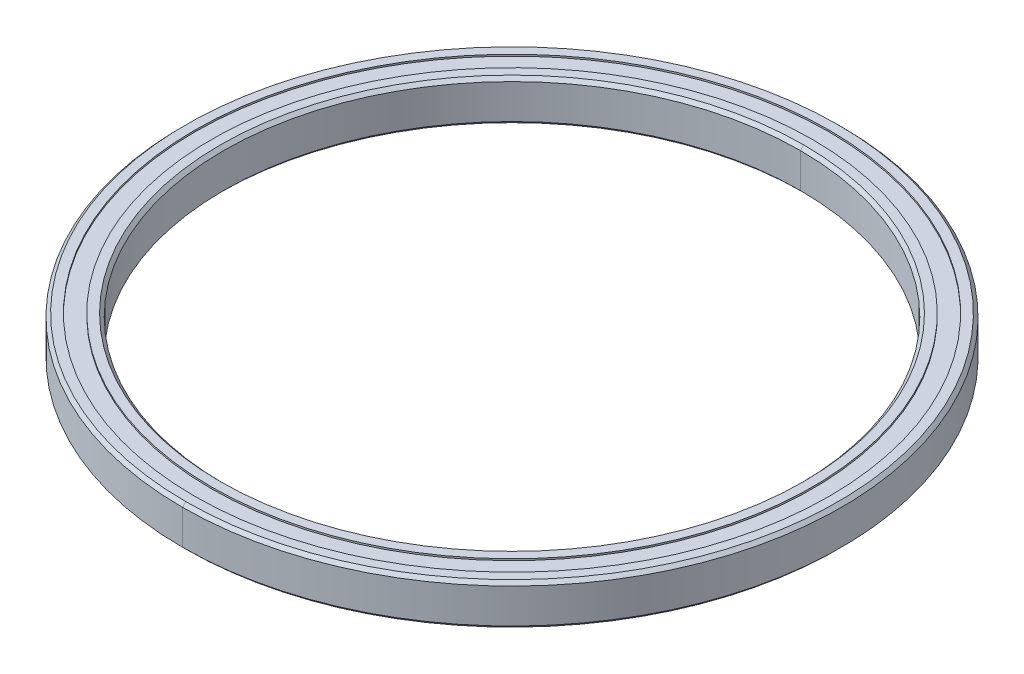
ISO-10303-21;
HEADER;
FILE_DESCRIPTION(('STEP AP214'),'2;1');
FILE_NAME('part.step','',(''),(''),'','','');
FILE_SCHEMA(('AUTOMOTIVE_DESIGN { 1 0 10303 214 1 1 1 1 }'));
ENDSEC;
DATA;
#1=APPLICATION_CONTEXT('core data for automotive mechanical design processes');
#2=APPLICATION_PROTOCOL_DEFINITION('international standard','automotive_design',2000,#1);
#3=PRODUCT_CONTEXT('',#1,'mechanical');
#4=PRODUCT('Part','Part','',(#3));
#5=PRODUCT_RELATED_PRODUCT_CATEGORY('part','',(#4));
#6=PRODUCT_DEFINITION_FORMATION('','',#4);
#7=PRODUCT_DEFINITION_CONTEXT('part definition',#1,'design');
#8=PRODUCT_DEFINITION('design','',#6,#7);
#9=PRODUCT_DEFINITION_SHAPE('','',#8);
#10=(LENGTH_UNIT() NAMED_UNIT(*) SI_UNIT(.MILLI.,.METRE.));
#11=(NAMED_UNIT(*) PLANE_ANGLE_UNIT() SI_UNIT($,.RADIAN.));
#12=(NAMED_UNIT(*) SI_UNIT($,.STERADIAN.) SOLID_ANGLE_UNIT());
#13=UNCERTAINTY_MEASURE_WITH_UNIT(LENGTH_MEASURE(1.E-05),#10,'distance_accuracy_value','');
#14=(GEOMETRIC_REPRESENTATION_CONTEXT(3) GLOBAL_UNCERTAINTY_ASSIGNED_CONTEXT((#13)) GLOBAL_UNIT_ASSIGNED_CONTEXT((#10,
#11,#12)) REPRESENTATION_CONTEXT('',''));
#15=CARTESIAN_POINT('',(0.,0.,0.));
#16=DIRECTION('',(0.,0.,1.));
#17=DIRECTION('',(1.,0.,0.));
#18=AXIS2_PLACEMENT_3D('',#15,#16,#17);
#19=CARTESIAN_POINT('',(0.,0.,0.));
#20=DIRECTION('',(0.,-1.,0.));
#21=DIRECTION('',(0.,0.,-1.));
#22=AXIS2_PLACEMENT_3D('',#19,#20,#21);
#23=CYLINDRICAL_SURFACE('',#22,50.8);
#24=DIRECTION('',(0.,-1.,0.));
#25=VECTOR('',#24,1.);
#26=CARTESIAN_POINT('',(0.,0.,50.8));
#27=LINE('',#26,#25);
#28=CARTESIAN_POINT('',(0.,2.667,50.8));
#29=VERTEX_POINT('',#28);
#30=CARTESIAN_POINT('',(0.,-2.667,50.8));
#31=VERTEX_POINT('',#30);
#32=EDGE_CURVE('E296',#29,#31,#27,.T.);
#33=ORIENTED_EDGE('',*,*,#32,.F.);
#34=CARTESIAN_POINT('',(0.,2.667,0.));
#35=DIRECTION('',(0.,-1.,0.));
#36=DIRECTION('',(0.,0.,-1.));
#37=AXIS2_PLACEMENT_3D('',#34,#35,#36);
#38=CIRCLE('',#37,50.8);
#39=CARTESIAN_POINT('',(0.,2.667,-50.8));
#40=VERTEX_POINT('',#39);
#41=EDGE_CURVE('E115',#29,#40,#38,.T.);
#42=ORIENTED_EDGE('',*,*,#41,.T.);
#43=DIRECTION('',(0.,-1.,0.));
#44=VECTOR('',#43,1.);
#45=CARTESIAN_POINT('',(0.,0.,-50.8));
#46=LINE('',#45,#44);
#47=CARTESIAN_POINT('',(0.,-2.667,-50.8));
#48=VERTEX_POINT('',#47);
#49=EDGE_CURVE('E357',#40,#48,#46,.T.);
#50=ORIENTED_EDGE('',*,*,#49,.T.);
#51=CARTESIAN_POINT('',(0.,-2.667,0.));
#52=DIRECTION('',(0.,-1.,0.));
#53=DIRECTION('',(0.,0.,-1.));
#54=AXIS2_PLACEMENT_3D('',#51,#52,#53);
#55=CIRCLE('',#54,50.8);
#56=EDGE_CURVE('E11',#31,#48,#55,.T.);
#57=ORIENTED_EDGE('',*,*,#56,.F.);
#58=EDGE_LOOP('',(#33,#42,#50,#57));
#59=FACE_BOUND('',#58,.T.);
#60=ADVANCED_FACE('F16',(#59),#23,.T.);
#61=CARTESIAN_POINT('',(0.,-2.667,0.));
#62=DIRECTION('',(0.,1.,0.));
#63=DIRECTION('',(0.,0.,1.));
#64=AXIS2_PLACEMENT_3D('',#61,#62,#63);
#65=CONICAL_SURFACE('',#64,50.8,0.785398163397446);
#66=DIRECTION('',(0.,0.707106781186549,-0.707106781186546));
#67=VECTOR('',#66,1.);
#68=CARTESIAN_POINT('',(0.,-2.667,-50.8));
#69=LINE('',#68,#67);
#70=CARTESIAN_POINT('',(0.,-3.175,-50.292));
#71=VERTEX_POINT('',#70);
#72=EDGE_CURVE('E356',#71,#48,#69,.T.);
#73=ORIENTED_EDGE('',*,*,#72,.F.);
#74=CARTESIAN_POINT('',(0.,-3.175,0.));
#75=DIRECTION('',(0.,-1.,0.));
#76=DIRECTION('',(0.,0.,-1.));
#77=AXIS2_PLACEMENT_3D('',#74,#75,#76);
#78=CIRCLE('',#77,50.292);
#79=CARTESIAN_POINT('',(0.,-3.175,50.292));
#80=VERTEX_POINT('',#79);
#81=EDGE_CURVE('E27',#80,#71,#78,.T.);
#82=ORIENTED_EDGE('',*,*,#81,.F.);
#83=DIRECTION('',(0.,0.707106781186549,0.707106781186546));
#84=VECTOR('',#83,1.);
#85=CARTESIAN_POINT('',(0.,-2.667,50.8));
#86=LINE('',#85,#84);
#87=EDGE_CURVE('E247',#80,#31,#86,.T.);
#88=ORIENTED_EDGE('',*,*,#87,.T.);
#89=ORIENTED_EDGE('',*,*,#56,.T.);
#90=EDGE_LOOP('',(#73,#82,#88,#89));
#91=FACE_BOUND('',#90,.T.);
#92=ADVANCED_FACE('F403',(#91),#65,.T.);
#93=CARTESIAN_POINT('',(-48.895,-3.175,0.));
#94=DIRECTION('',(0.,1.,0.));
#95=DIRECTION('',(1.,0.,0.));
#96=AXIS2_PLACEMENT_3D('',#93,#94,#95);
#97=PLANE('',#96);
#98=CARTESIAN_POINT('',(0.,-3.175,0.));
#99=DIRECTION('',(0.,-1.,0.));
#100=DIRECTION('',(0.,0.,-1.));
#101=AXIS2_PLACEMENT_3D('',#98,#99,#100);
#102=CIRCLE('',#101,48.895);
#103=CARTESIAN_POINT('',(0.,-3.175,-48.895));
#104=VERTEX_POINT('',#103);
#105=CARTESIAN_POINT('',(0.,-3.175,48.895));
#106=VERTEX_POINT('',#105);
#107=EDGE_CURVE('E90',#104,#106,#102,.T.);
#108=ORIENTED_EDGE('',*,*,#107,.F.);
#109=CARTESIAN_POINT('',(0.,-3.175,0.));
#110=DIRECTION('',(0.,-1.,0.));
#111=DIRECTION('',(0.,0.,-1.));
#112=AXIS2_PLACEMENT_3D('',#109,#110,#111);
#113=CIRCLE('',#112,48.895);
#114=EDGE_CURVE('E252',#106,#104,#113,.T.);
#115=ORIENTED_EDGE('',*,*,#114,.F.);
#116=EDGE_LOOP('',(#108,#115));
#117=FACE_BOUND('',#116,.T.);
#118=ORIENTED_EDGE('',*,*,#81,.T.);
#119=CARTESIAN_POINT('',(0.,-3.175,0.));
#120=DIRECTION('',(0.,-1.,0.));
#121=DIRECTION('',(0.,0.,-1.));
#122=AXIS2_PLACEMENT_3D('',#119,#120,#121);
#123=CIRCLE('',#122,50.292);
#124=EDGE_CURVE('E352',#71,#80,#123,.T.);
#125=ORIENTED_EDGE('',*,*,#124,.T.);
#126=EDGE_LOOP('',(#118,#125));
#127=FACE_BOUND('',#126,.T.);
#128=ADVANCED_FACE('F399',(#117,#127),#97,.F.);
#129=CARTESIAN_POINT('',(0.,0.,0.));
#130=DIRECTION('',(0.,-1.,0.));
#131=DIRECTION('',(0.,0.,-1.));
#132=AXIS2_PLACEMENT_3D('',#129,#130,#131);
#133=CYLINDRICAL_SURFACE('',#132,48.895);
#134=DIRECTION('',(0.,-1.,0.));
#135=VECTOR('',#134,1.);
#136=CARTESIAN_POINT('',(0.,0.,48.895));
#137=LINE('',#136,#135);
#138=CARTESIAN_POINT('',(0.,-2.921,48.895));
#139=VERTEX_POINT('',#138);
#140=EDGE_CURVE('E246',#139,#106,#137,.T.);
#141=ORIENTED_EDGE('',*,*,#140,.F.);
#142=CARTESIAN_POINT('',(0.,-2.921,0.));
#143=DIRECTION('',(0.,-1.,0.));
#144=DIRECTION('',(0.,0.,-1.));
#145=AXIS2_PLACEMENT_3D('',#142,#143,#144);
#146=CIRCLE('',#145,48.895);
#147=CARTESIAN_POINT('',(0.,-2.921,-48.895));
#148=VERTEX_POINT('',#147);
#149=EDGE_CURVE('E301',#148,#139,#146,.T.);
#150=ORIENTED_EDGE('',*,*,#149,.F.);
#151=DIRECTION('',(0.,-1.,0.));
#152=VECTOR('',#151,1.);
#153=CARTESIAN_POINT('',(0.,0.,-48.895));
#154=LINE('',#153,#152);
#155=EDGE_CURVE('E248',#148,#104,#154,.T.);
#156=ORIENTED_EDGE('',*,*,#155,.T.);
#157=ORIENTED_EDGE('',*,*,#107,.T.);
#158=EDGE_LOOP('',(#141,#150,#156,#157));
#159=FACE_BOUND('',#158,.T.);
#160=ADVANCED_FACE('F402',(#159),#133,.F.);
#161=CARTESIAN_POINT('',(-46.355,-2.921,0.));
#162=DIRECTION('',(0.,1.,0.));
#163=DIRECTION('',(1.,0.,0.));
#164=AXIS2_PLACEMENT_3D('',#161,#162,#163);
#165=PLANE('',#164);
#166=CARTESIAN_POINT('',(0.,-2.921,0.));
#167=DIRECTION('',(0.,-1.,0.));
#168=DIRECTION('',(0.,0.,-1.));
#169=AXIS2_PLACEMENT_3D('',#166,#167,#168);
#170=CIRCLE('',#169,46.355);
#171=CARTESIAN_POINT('',(0.,-2.921,-46.355));
#172=VERTEX_POINT('',#171);
#173=CARTESIAN_POINT('',(0.,-2.921,46.355));
#174=VERTEX_POINT('',#173);
#175=EDGE_CURVE('E251',#172,#174,#170,.T.);
#176=ORIENTED_EDGE('',*,*,#175,.F.);
#177=CARTESIAN_POINT('',(0.,-2.921,0.));
#178=DIRECTION('',(0.,-1.,0.));
#179=DIRECTION('',(0.,0.,-1.));
#180=AXIS2_PLACEMENT_3D('',#177,#178,#179);
#181=CIRCLE('',#180,46.355);
#182=EDGE_CURVE('E74',#174,#172,#181,.T.);
#183=ORIENTED_EDGE('',*,*,#182,.F.);
#184=EDGE_LOOP('',(#176,#183));
#185=FACE_BOUND('',#184,.T.);
#186=ORIENTED_EDGE('',*,*,#149,.T.);
#187=CARTESIAN_POINT('',(0.,-2.921,0.));
#188=DIRECTION('',(0.,-1.,0.));
#189=DIRECTION('',(0.,0.,-1.));
#190=AXIS2_PLACEMENT_3D('',#187,#188,#189);
#191=CIRCLE('',#190,48.895);
#192=EDGE_CURVE('E242',#139,#148,#191,.T.);
#193=ORIENTED_EDGE('',*,*,#192,.T.);
#194=EDGE_LOOP('',(#186,#193));
#195=FACE_BOUND('',#194,.T.);
#196=ADVANCED_FACE('F476',(#185,#195),#165,.F.);
#197=CARTESIAN_POINT('',(0.,0.,0.));
#198=DIRECTION('',(0.,-1.,0.));
#199=DIRECTION('',(0.,0.,-1.));
#200=AXIS2_PLACEMENT_3D('',#197,#198,#199);
#201=CYLINDRICAL_SURFACE('',#200,46.355);
#202=DIRECTION('',(0.,-1.,0.));
#203=VECTOR('',#202,1.);
#204=CARTESIAN_POINT('',(0.,0.,46.355));
#205=LINE('',#204,#203);
#206=CARTESIAN_POINT('',(0.,-3.175,46.355));
#207=VERTEX_POINT('',#206);
#208=EDGE_CURVE('E264',#174,#207,#205,.T.);
#209=ORIENTED_EDGE('',*,*,#208,.F.);
#210=ORIENTED_EDGE('',*,*,#182,.T.);
#211=DIRECTION('',(0.,-1.,0.));
#212=VECTOR('',#211,1.);
#213=CARTESIAN_POINT('',(0.,0.,-46.355));
#214=LINE('',#213,#212);
#215=CARTESIAN_POINT('',(0.,-3.175,-46.355));
#216=VERTEX_POINT('',#215);
#217=EDGE_CURVE('E276',#172,#216,#214,.T.);
#218=ORIENTED_EDGE('',*,*,#217,.T.);
#219=CARTESIAN_POINT('',(0.,-3.175,0.));
#220=DIRECTION('',(0.,-1.,0.));
#221=DIRECTION('',(0.,0.,-1.));
#222=AXIS2_PLACEMENT_3D('',#219,#220,#221);
#223=CIRCLE('',#222,46.355);
#224=EDGE_CURVE('E362',#207,#216,#223,.T.);
#225=ORIENTED_EDGE('',*,*,#224,.F.);
#226=EDGE_LOOP('',(#209,#210,#218,#225));
#227=FACE_BOUND('',#226,.T.);
#228=ADVANCED_FACE('F443',(#227),#201,.T.);
#229=CARTESIAN_POINT('',(-44.958,-3.175,0.));
#230=DIRECTION('',(0.,1.,0.));
#231=DIRECTION('',(1.,0.,0.));
#232=AXIS2_PLACEMENT_3D('',#229,#230,#231);
#233=PLANE('',#232);
#234=CARTESIAN_POINT('',(0.,-3.175,0.));
#235=DIRECTION('',(0.,-1.,0.));
#236=DIRECTION('',(0.,0.,-1.));
#237=AXIS2_PLACEMENT_3D('',#234,#235,#236);
#238=CIRCLE('',#237,44.958);
#239=CARTESIAN_POINT('',(0.,-3.175,-44.958));
#240=VERTEX_POINT('',#239);
#241=CARTESIAN_POINT('',(0.,-3.175,44.958));
#242=VERTEX_POINT('',#241);
#243=EDGE_CURVE('E173',#240,#242,#238,.T.);
#244=ORIENTED_EDGE('',*,*,#243,.F.);
#245=CARTESIAN_POINT('',(0.,-3.175,0.));
#246=DIRECTION('',(0.,-1.,0.));
#247=DIRECTION('',(0.,0.,-1.));
#248=AXIS2_PLACEMENT_3D('',#245,#246,#247);
#249=CIRCLE('',#248,44.958);
#250=EDGE_CURVE('E291',#242,#240,#249,.T.);
#251=ORIENTED_EDGE('',*,*,#250,.F.);
#252=EDGE_LOOP('',(#244,#251));
#253=FACE_BOUND('',#252,.T.);
#254=CARTESIAN_POINT('',(0.,-3.175,0.));
#255=DIRECTION('',(0.,-1.,0.));
#256=DIRECTION('',(0.,0.,-1.));
#257=AXIS2_PLACEMENT_3D('',#254,#255,#256);
#258=CIRCLE('',#257,46.355);
#259=EDGE_CURVE('E267',#216,#207,#258,.T.);
#260=ORIENTED_EDGE('',*,*,#259,.T.);
#261=ORIENTED_EDGE('',*,*,#224,.T.);
#262=EDGE_LOOP('',(#260,#261));
#263=FACE_BOUND('',#262,.T.);
#264=ADVANCED_FACE('F470',(#253,#263),#233,.F.);
#265=CARTESIAN_POINT('',(0.,-3.175,0.));
#266=DIRECTION('',(0.,-1.,0.));
#267=DIRECTION('',(0.,0.,-1.));
#268=AXIS2_PLACEMENT_3D('',#265,#266,#267);
#269=CONICAL_SURFACE('',#268,44.958,0.785398163397445);
#270=DIRECTION('',(0.,-0.70710678118655,0.707106781186545));
#271=VECTOR('',#270,1.);
#272=CARTESIAN_POINT('',(0.,-3.175,44.958));
#273=LINE('',#272,#271);
#274=CARTESIAN_POINT('',(0.,-2.667,44.45));
#275=VERTEX_POINT('',#274);
#276=EDGE_CURVE('E287',#275,#242,#273,.T.);
#277=ORIENTED_EDGE('',*,*,#276,.F.);
#278=CARTESIAN_POINT('',(0.,-2.667,0.));
#279=DIRECTION('',(0.,-1.,0.));
#280=DIRECTION('',(0.,0.,-1.));
#281=AXIS2_PLACEMENT_3D('',#278,#279,#280);
#282=CIRCLE('',#281,44.45);
#283=CARTESIAN_POINT('',(0.,-2.667,-44.45));
#284=VERTEX_POINT('',#283);
#285=EDGE_CURVE('E284',#284,#275,#282,.T.);
#286=ORIENTED_EDGE('',*,*,#285,.F.);
#287=DIRECTION('',(0.,-0.70710678118655,-0.707106781186545));
#288=VECTOR('',#287,1.);
#289=CARTESIAN_POINT('',(0.,-3.175,-44.958));
#290=LINE('',#289,#288);
#291=EDGE_CURVE('E306',#284,#240,#290,.T.);
#292=ORIENTED_EDGE('',*,*,#291,.T.);
#293=ORIENTED_EDGE('',*,*,#243,.T.);
#294=EDGE_LOOP('',(#277,#286,#292,#293));
#295=FACE_BOUND('',#294,.T.);
#296=ADVANCED_FACE('F469',(#295),#269,.F.);
#297=CARTESIAN_POINT('',(0.,0.,0.));
#298=DIRECTION('',(0.,-1.,0.));
#299=DIRECTION('',(0.,0.,-1.));
#300=AXIS2_PLACEMENT_3D('',#297,#298,#299);
#301=CYLINDRICAL_SURFACE('',#300,44.45);
#302=DIRECTION('',(0.,-1.,0.));
#303=VECTOR('',#302,1.);
#304=CARTESIAN_POINT('',(0.,0.,44.45));
#305=LINE('',#304,#303);
#306=CARTESIAN_POINT('',(0.,2.667,44.45));
#307=VERTEX_POINT('',#306);
#308=EDGE_CURVE('E263',#307,#275,#305,.T.);
#309=ORIENTED_EDGE('',*,*,#308,.F.);
#310=CARTESIAN_POINT('',(0.,2.667,0.));
#311=DIRECTION('',(0.,-1.,0.));
#312=DIRECTION('',(0.,0.,-1.));
#313=AXIS2_PLACEMENT_3D('',#310,#311,#312);
#314=CIRCLE('',#313,44.45);
#315=CARTESIAN_POINT('',(0.,2.667,-44.45));
#316=VERTEX_POINT('',#315);
#317=EDGE_CURVE('E182',#316,#307,#314,.T.);
#318=ORIENTED_EDGE('',*,*,#317,.F.);
#319=DIRECTION('',(0.,-1.,0.));
#320=VECTOR('',#319,1.);
#321=CARTESIAN_POINT('',(0.,0.,-44.45));
#322=LINE('',#321,#320);
#323=EDGE_CURVE('E259',#316,#284,#322,.T.);
#324=ORIENTED_EDGE('',*,*,#323,.T.);
#325=ORIENTED_EDGE('',*,*,#285,.T.);
#326=EDGE_LOOP('',(#309,#318,#324,#325));
#327=FACE_BOUND('',#326,.T.);
#328=ADVANCED_FACE('F18',(#327),#301,.F.);
#329=CARTESIAN_POINT('',(0.,2.667,0.));
#330=DIRECTION('',(0.,1.,0.));
#331=DIRECTION('',(0.,0.,1.));
#332=AXIS2_PLACEMENT_3D('',#329,#330,#331);
#333=CONICAL_SURFACE('',#332,44.45,0.785398163397448);
#334=DIRECTION('',(0.,0.707106781186548,-0.707106781186547));
#335=VECTOR('',#334,1.);
#336=CARTESIAN_POINT('',(0.,2.667,-44.45));
#337=LINE('',#336,#335);
#338=CARTESIAN_POINT('',(0.,3.175,-44.958));
#339=VERTEX_POINT('',#338);
#340=EDGE_CURVE('E262',#316,#339,#337,.T.);
#341=ORIENTED_EDGE('',*,*,#340,.F.);
#342=ORIENTED_EDGE('',*,*,#317,.T.);
#343=DIRECTION('',(0.,0.707106781186548,0.707106781186547));
#344=VECTOR('',#343,1.);
#345=CARTESIAN_POINT('',(0.,2.667,44.45));
#346=LINE('',#345,#344);
#347=CARTESIAN_POINT('',(0.,3.175,44.958));
#348=VERTEX_POINT('',#347);
#349=EDGE_CURVE('E223',#307,#348,#346,.T.);
#350=ORIENTED_EDGE('',*,*,#349,.T.);
#351=CARTESIAN_POINT('',(0.,3.175,0.));
#352=DIRECTION('',(0.,-1.,0.));
#353=DIRECTION('',(0.,0.,-1.));
#354=AXIS2_PLACEMENT_3D('',#351,#352,#353);
#355=CIRCLE('',#354,44.958);
#356=EDGE_CURVE('E210',#339,#348,#355,.T.);
#357=ORIENTED_EDGE('',*,*,#356,.F.);
#358=EDGE_LOOP('',(#341,#342,#350,#357));
#359=FACE_BOUND('',#358,.T.);
#360=ADVANCED_FACE('F607',(#359),#333,.F.);
#361=CARTESIAN_POINT('',(-46.355,3.175,0.));
#362=DIRECTION('',(0.,-1.,0.));
#363=DIRECTION('',(0.,0.,-1.));
#364=AXIS2_PLACEMENT_3D('',#361,#362,#363);
#365=PLANE('',#364);
#366=CARTESIAN_POINT('',(0.,3.175,0.));
#367=DIRECTION('',(0.,-1.,0.));
#368=DIRECTION('',(0.,0.,-1.));
#369=AXIS2_PLACEMENT_3D('',#366,#367,#368);
#370=CIRCLE('',#369,44.958);
#371=EDGE_CURVE('E231',#348,#339,#370,.T.);
#372=ORIENTED_EDGE('',*,*,#371,.T.);
#373=ORIENTED_EDGE('',*,*,#356,.T.);
#374=EDGE_LOOP('',(#372,#373));
#375=FACE_BOUND('',#374,.T.);
#376=CARTESIAN_POINT('',(0.,3.175,0.));
#377=DIRECTION('',(0.,-1.,0.));
#378=DIRECTION('',(0.,0.,-1.));
#379=AXIS2_PLACEMENT_3D('',#376,#377,#378);
#380=CIRCLE('',#379,46.355);
#381=CARTESIAN_POINT('',(0.,3.175,-46.355));
#382=VERTEX_POINT('',#381);
#383=CARTESIAN_POINT('',(0.,3.175,46.355));
#384=VERTEX_POINT('',#383);
#385=EDGE_CURVE('E215',#382,#384,#380,.T.);
#386=ORIENTED_EDGE('',*,*,#385,.F.);
#387=CARTESIAN_POINT('',(0.,3.175,0.));
#388=DIRECTION('',(0.,-1.,0.));
#389=DIRECTION('',(0.,0.,-1.));
#390=AXIS2_PLACEMENT_3D('',#387,#388,#389);
#391=CIRCLE('',#390,46.355);
#392=EDGE_CURVE('E199',#384,#382,#391,.T.);
#393=ORIENTED_EDGE('',*,*,#392,.F.);
#394=EDGE_LOOP('',(#386,#393));
#395=FACE_BOUND('',#394,.T.);
#396=ADVANCED_FACE('F221',(#375,#395),#365,.F.);
#397=CARTESIAN_POINT('',(0.,0.,0.));
#398=DIRECTION('',(0.,-1.,0.));
#399=DIRECTION('',(0.,0.,-1.));
#400=AXIS2_PLACEMENT_3D('',#397,#398,#399);
#401=CYLINDRICAL_SURFACE('',#400,46.355);
#402=DIRECTION('',(0.,-1.,0.));
#403=VECTOR('',#402,1.);
#404=CARTESIAN_POINT('',(0.,0.,46.355));
#405=LINE('',#404,#403);
#406=CARTESIAN_POINT('',(0.,2.921,46.355));
#407=VERTEX_POINT('',#406);
#408=EDGE_CURVE('E205',#384,#407,#405,.T.);
#409=ORIENTED_EDGE('',*,*,#408,.F.);
#410=ORIENTED_EDGE('',*,*,#392,.T.);
#411=DIRECTION('',(0.,-1.,0.));
#412=VECTOR('',#411,1.);
#413=CARTESIAN_POINT('',(0.,0.,-46.355));
#414=LINE('',#413,#412);
#415=CARTESIAN_POINT('',(0.,2.921,-46.355));
#416=VERTEX_POINT('',#415);
#417=EDGE_CURVE('E202',#382,#416,#414,.T.);
#418=ORIENTED_EDGE('',*,*,#417,.T.);
#419=CARTESIAN_POINT('',(0.,2.921,0.));
#420=DIRECTION('',(0.,-1.,0.));
#421=DIRECTION('',(0.,0.,-1.));
#422=AXIS2_PLACEMENT_3D('',#419,#420,#421);
#423=CIRCLE('',#422,46.355);
#424=EDGE_CURVE('E211',#407,#416,#423,.T.);
#425=ORIENTED_EDGE('',*,*,#424,.F.);
#426=EDGE_LOOP('',(#409,#410,#418,#425));
#427=FACE_BOUND('',#426,.T.);
#428=ADVANCED_FACE('F201',(#427),#401,.T.);
#429=CARTESIAN_POINT('',(-48.895,2.921,0.));
#430=DIRECTION('',(0.,-1.,0.));
#431=DIRECTION('',(0.,0.,-1.));
#432=AXIS2_PLACEMENT_3D('',#429,#430,#431);
#433=PLANE('',#432);
#434=CARTESIAN_POINT('',(0.,2.921,0.));
#435=DIRECTION('',(0.,-1.,0.));
#436=DIRECTION('',(0.,0.,-1.));
#437=AXIS2_PLACEMENT_3D('',#434,#435,#436);
#438=CIRCLE('',#437,46.355);
#439=EDGE_CURVE('E217',#416,#407,#438,.T.);
#440=ORIENTED_EDGE('',*,*,#439,.T.);
#441=ORIENTED_EDGE('',*,*,#424,.T.);
#442=EDGE_LOOP('',(#440,#441));
#443=FACE_BOUND('',#442,.T.);
#444=CARTESIAN_POINT('',(0.,2.921,0.));
#445=DIRECTION('',(0.,-1.,0.));
#446=DIRECTION('',(0.,0.,-1.));
#447=AXIS2_PLACEMENT_3D('',#444,#445,#446);
#448=CIRCLE('',#447,48.895);
#449=CARTESIAN_POINT('',(0.,2.921,-48.895));
#450=VERTEX_POINT('',#449);
#451=CARTESIAN_POINT('',(0.,2.921,48.895));
#452=VERTEX_POINT('',#451);
#453=EDGE_CURVE('E325',#450,#452,#448,.T.);
#454=ORIENTED_EDGE('',*,*,#453,.F.);
#455=CARTESIAN_POINT('',(0.,2.921,0.));
#456=DIRECTION('',(0.,-1.,0.));
#457=DIRECTION('',(0.,0.,-1.));
#458=AXIS2_PLACEMENT_3D('',#455,#456,#457);
#459=CIRCLE('',#458,48.895);
#460=EDGE_CURVE('E258',#452,#450,#459,.T.);
#461=ORIENTED_EDGE('',*,*,#460,.F.);
#462=EDGE_LOOP('',(#454,#461));
#463=FACE_BOUND('',#462,.T.);
#464=ADVANCED_FACE('F430',(#443,#463),#433,.F.);
#465=CARTESIAN_POINT('',(0.,0.,0.));
#466=DIRECTION('',(0.,-1.,0.));
#467=DIRECTION('',(0.,0.,-1.));
#468=AXIS2_PLACEMENT_3D('',#465,#466,#467);
#469=CYLINDRICAL_SURFACE('',#468,48.895);
#470=DIRECTION('',(0.,-1.,0.));
#471=VECTOR('',#470,1.);
#472=CARTESIAN_POINT('',(0.,0.,48.895));
#473=LINE('',#472,#471);
#474=CARTESIAN_POINT('',(0.,3.175,48.895));
#475=VERTEX_POINT('',#474);
#476=EDGE_CURVE('E319',#475,#452,#473,.T.);
#477=ORIENTED_EDGE('',*,*,#476,.F.);
#478=CARTESIAN_POINT('',(0.,3.175,0.));
#479=DIRECTION('',(0.,-1.,0.));
#480=DIRECTION('',(0.,0.,-1.));
#481=AXIS2_PLACEMENT_3D('',#478,#479,#480);
#482=CIRCLE('',#481,48.895);
#483=CARTESIAN_POINT('',(0.,3.175,-48.895));
#484=VERTEX_POINT('',#483);
#485=EDGE_CURVE('E20',#484,#475,#482,.T.);
#486=ORIENTED_EDGE('',*,*,#485,.F.);
#487=DIRECTION('',(0.,-1.,0.));
#488=VECTOR('',#487,1.);
#489=CARTESIAN_POINT('',(0.,0.,-48.895));
#490=LINE('',#489,#488);
#491=EDGE_CURVE('E253',#484,#450,#490,.T.);
#492=ORIENTED_EDGE('',*,*,#491,.T.);
#493=ORIENTED_EDGE('',*,*,#453,.T.);
#494=EDGE_LOOP('',(#477,#486,#492,#493));
#495=FACE_BOUND('',#494,.T.);
#496=ADVANCED_FACE('F421',(#495),#469,.F.);
#497=CARTESIAN_POINT('',(-50.292,3.175,0.));
#498=DIRECTION('',(0.,-1.,0.));
#499=DIRECTION('',(0.,0.,-1.));
#500=AXIS2_PLACEMENT_3D('',#497,#498,#499);
#501=PLANE('',#500);
#502=ORIENTED_EDGE('',*,*,#485,.T.);
#503=CARTESIAN_POINT('',(0.,3.175,0.));
#504=DIRECTION('',(0.,-1.,0.));
#505=DIRECTION('',(0.,0.,-1.));
#506=AXIS2_PLACEMENT_3D('',#503,#504,#505);
#507=CIRCLE('',#506,48.895);
#508=EDGE_CURVE('E219',#475,#484,#507,.T.);
#509=ORIENTED_EDGE('',*,*,#508,.T.);
#510=EDGE_LOOP('',(#502,#509));
#511=FACE_BOUND('',#510,.T.);
#512=CARTESIAN_POINT('',(0.,3.175,0.));
#513=DIRECTION('',(0.,-1.,0.));
#514=DIRECTION('',(0.,0.,-1.));
#515=AXIS2_PLACEMENT_3D('',#512,#513,#514);
#516=CIRCLE('',#515,50.292);
#517=CARTESIAN_POINT('',(0.,3.175,-50.292));
#518=VERTEX_POINT('',#517);
#519=CARTESIAN_POINT('',(0.,3.175,50.292));
#520=VERTEX_POINT('',#519);
#521=EDGE_CURVE('E257',#518,#520,#516,.T.);
#522=ORIENTED_EDGE('',*,*,#521,.F.);
#523=CARTESIAN_POINT('',(0.,3.175,0.));
#524=DIRECTION('',(0.,-1.,0.));
#525=DIRECTION('',(0.,0.,-1.));
#526=AXIS2_PLACEMENT_3D('',#523,#524,#525);
#527=CIRCLE('',#526,50.292);
#528=EDGE_CURVE('E41',#520,#518,#527,.T.);
#529=ORIENTED_EDGE('',*,*,#528,.F.);
#530=EDGE_LOOP('',(#522,#529));
#531=FACE_BOUND('',#530,.T.);
#532=ADVANCED_FACE('F418',(#511,#531),#501,.F.);
#533=CARTESIAN_POINT('',(0.,3.175,0.));
#534=DIRECTION('',(0.,-1.,0.));
#535=DIRECTION('',(0.,0.,-1.));
#536=AXIS2_PLACEMENT_3D('',#533,#534,#535);
#537=CONICAL_SURFACE('',#536,50.292,0.785398163397459);
#538=DIRECTION('',(0.,-0.70710678118654,0.707106781186555));
#539=VECTOR('',#538,1.);
#540=CARTESIAN_POINT('',(0.,3.175,50.292));
#541=LINE('',#540,#539);
#542=EDGE_CURVE('E328',#520,#29,#541,.T.);
#543=ORIENTED_EDGE('',*,*,#542,.F.);
#544=ORIENTED_EDGE('',*,*,#528,.T.);
#545=DIRECTION('',(0.,-0.70710678118654,-0.707106781186555));
#546=VECTOR('',#545,1.);
#547=CARTESIAN_POINT('',(0.,3.175,-50.292));
#548=LINE('',#547,#546);
#549=EDGE_CURVE('E241',#518,#40,#548,.T.);
#550=ORIENTED_EDGE('',*,*,#549,.T.);
#551=ORIENTED_EDGE('',*,*,#41,.F.);
#552=EDGE_LOOP('',(#543,#544,#550,#551));
#553=FACE_BOUND('',#552,.T.);
#554=ADVANCED_FACE('F420',(#553),#537,.T.);
#555=CARTESIAN_POINT('',(0.,3.175,0.));
#556=DIRECTION('',(0.,-1.,0.));
#557=DIRECTION('',(0.,0.,-1.));
#558=AXIS2_PLACEMENT_3D('',#555,#556,#557);
#559=CONICAL_SURFACE('',#558,50.292,0.785398163397459);
#560=ORIENTED_EDGE('',*,*,#521,.T.);
#561=ORIENTED_EDGE('',*,*,#542,.T.);
#562=CARTESIAN_POINT('',(0.,2.667,0.));
#563=DIRECTION('',(0.,-1.,0.));
#564=DIRECTION('',(0.,0.,-1.));
#565=AXIS2_PLACEMENT_3D('',#562,#563,#564);
#566=CIRCLE('',#565,50.8);
#567=EDGE_CURVE('E293',#40,#29,#566,.T.);
#568=ORIENTED_EDGE('',*,*,#567,.F.);
#569=ORIENTED_EDGE('',*,*,#549,.F.);
#570=EDGE_LOOP('',(#560,#561,#568,#569));
#571=FACE_BOUND('',#570,.T.);
#572=ADVANCED_FACE('F417',(#571),#559,.T.);
#573=CARTESIAN_POINT('',(0.,0.,0.));
#574=DIRECTION('',(0.,-1.,0.));
#575=DIRECTION('',(0.,0.,-1.));
#576=AXIS2_PLACEMENT_3D('',#573,#574,#575);
#577=CYLINDRICAL_SURFACE('',#576,48.895);
#578=ORIENTED_EDGE('',*,*,#508,.F.);
#579=ORIENTED_EDGE('',*,*,#476,.T.);
#580=ORIENTED_EDGE('',*,*,#460,.T.);
#581=ORIENTED_EDGE('',*,*,#491,.F.);
#582=EDGE_LOOP('',(#578,#579,#580,#581));
#583=FACE_BOUND('',#582,.T.);
#584=ADVANCED_FACE('F445',(#583),#577,.F.);
#585=CARTESIAN_POINT('',(0.,0.,0.));
#586=DIRECTION('',(0.,-1.,0.));
#587=DIRECTION('',(0.,0.,-1.));
#588=AXIS2_PLACEMENT_3D('',#585,#586,#587);
#589=CYLINDRICAL_SURFACE('',#588,46.355);
#590=ORIENTED_EDGE('',*,*,#385,.T.);
#591=ORIENTED_EDGE('',*,*,#408,.T.);
#592=ORIENTED_EDGE('',*,*,#439,.F.);
#593=ORIENTED_EDGE('',*,*,#417,.F.);
#594=EDGE_LOOP('',(#590,#591,#592,#593));
#595=FACE_BOUND('',#594,.T.);
#596=ADVANCED_FACE('F214',(#595),#589,.T.);
#597=CARTESIAN_POINT('',(0.,2.667,0.));
#598=DIRECTION('',(0.,1.,0.));
#599=DIRECTION('',(0.,0.,1.));
#600=AXIS2_PLACEMENT_3D('',#597,#598,#599);
#601=CONICAL_SURFACE('',#600,44.45,0.785398163397448);
#602=CARTESIAN_POINT('',(0.,2.667,0.));
#603=DIRECTION('',(0.,-1.,0.));
#604=DIRECTION('',(0.,0.,-1.));
#605=AXIS2_PLACEMENT_3D('',#602,#603,#604);
#606=CIRCLE('',#605,44.45);
#607=EDGE_CURVE('E331',#307,#316,#606,.T.);
#608=ORIENTED_EDGE('',*,*,#607,.T.);
#609=ORIENTED_EDGE('',*,*,#340,.T.);
#610=ORIENTED_EDGE('',*,*,#371,.F.);
#611=ORIENTED_EDGE('',*,*,#349,.F.);
#612=EDGE_LOOP('',(#608,#609,#610,#611));
#613=FACE_BOUND('',#612,.T.);
#614=ADVANCED_FACE('F448',(#613),#601,.F.);
#615=CARTESIAN_POINT('',(0.,0.,0.));
#616=DIRECTION('',(0.,-1.,0.));
#617=DIRECTION('',(0.,0.,-1.));
#618=AXIS2_PLACEMENT_3D('',#615,#616,#617);
#619=CYLINDRICAL_SURFACE('',#618,44.45);
#620=ORIENTED_EDGE('',*,*,#607,.F.);
#621=ORIENTED_EDGE('',*,*,#308,.T.);
#622=CARTESIAN_POINT('',(0.,-2.667,0.));
#623=DIRECTION('',(0.,-1.,0.));
#624=DIRECTION('',(0.,0.,-1.));
#625=AXIS2_PLACEMENT_3D('',#622,#623,#624);
#626=CIRCLE('',#625,44.45);
#627=EDGE_CURVE('E292',#275,#284,#626,.T.);
#628=ORIENTED_EDGE('',*,*,#627,.T.);
#629=ORIENTED_EDGE('',*,*,#323,.F.);
#630=EDGE_LOOP('',(#620,#621,#628,#629));
#631=FACE_BOUND('',#630,.T.);
#632=ADVANCED_FACE('F450',(#631),#619,.F.);
#633=CARTESIAN_POINT('',(0.,-3.175,0.));
#634=DIRECTION('',(0.,-1.,0.));
#635=DIRECTION('',(0.,0.,-1.));
#636=AXIS2_PLACEMENT_3D('',#633,#634,#635);
#637=CONICAL_SURFACE('',#636,44.958,0.785398163397445);
#638=ORIENTED_EDGE('',*,*,#627,.F.);
#639=ORIENTED_EDGE('',*,*,#276,.T.);
#640=ORIENTED_EDGE('',*,*,#250,.T.);
#641=ORIENTED_EDGE('',*,*,#291,.F.);
#642=EDGE_LOOP('',(#638,#639,#640,#641));
#643=FACE_BOUND('',#642,.T.);
#644=ADVANCED_FACE('F456',(#643),#637,.F.);
#645=CARTESIAN_POINT('',(0.,0.,0.));
#646=DIRECTION('',(0.,-1.,0.));
#647=DIRECTION('',(0.,0.,-1.));
#648=AXIS2_PLACEMENT_3D('',#645,#646,#647);
#649=CYLINDRICAL_SURFACE('',#648,46.355);
#650=ORIENTED_EDGE('',*,*,#175,.T.);
#651=ORIENTED_EDGE('',*,*,#208,.T.);
#652=ORIENTED_EDGE('',*,*,#259,.F.);
#653=ORIENTED_EDGE('',*,*,#217,.F.);
#654=EDGE_LOOP('',(#650,#651,#652,#653));
#655=FACE_BOUND('',#654,.T.);
#656=ADVANCED_FACE('F474',(#655),#649,.T.);
#657=CARTESIAN_POINT('',(0.,0.,0.));
#658=DIRECTION('',(0.,-1.,0.));
#659=DIRECTION('',(0.,0.,-1.));
#660=AXIS2_PLACEMENT_3D('',#657,#658,#659);
#661=CYLINDRICAL_SURFACE('',#660,48.895);
#662=ORIENTED_EDGE('',*,*,#192,.F.);
#663=ORIENTED_EDGE('',*,*,#140,.T.);
#664=ORIENTED_EDGE('',*,*,#114,.T.);
#665=ORIENTED_EDGE('',*,*,#155,.F.);
#666=EDGE_LOOP('',(#662,#663,#664,#665));
#667=FACE_BOUND('',#666,.T.);
#668=ADVANCED_FACE('F397',(#667),#661,.F.);
#669=CARTESIAN_POINT('',(0.,-2.667,0.));
#670=DIRECTION('',(0.,1.,0.));
#671=DIRECTION('',(0.,0.,1.));
#672=AXIS2_PLACEMENT_3D('',#669,#670,#671);
#673=CONICAL_SURFACE('',#672,50.8,0.785398163397446);
#674=ORIENTED_EDGE('',*,*,#124,.F.);
#675=ORIENTED_EDGE('',*,*,#72,.T.);
#676=CARTESIAN_POINT('',(0.,-2.667,0.));
#677=DIRECTION('',(0.,-1.,0.));
#678=DIRECTION('',(0.,0.,-1.));
#679=AXIS2_PLACEMENT_3D('',#676,#677,#678);
#680=CIRCLE('',#679,50.8);
#681=EDGE_CURVE('E235',#48,#31,#680,.T.);
#682=ORIENTED_EDGE('',*,*,#681,.T.);
#683=ORIENTED_EDGE('',*,*,#87,.F.);
#684=EDGE_LOOP('',(#674,#675,#682,#683));
#685=FACE_BOUND('',#684,.T.);
#686=ADVANCED_FACE('F411',(#685),#673,.T.);
#687=CARTESIAN_POINT('',(0.,0.,0.));
#688=DIRECTION('',(0.,-1.,0.));
#689=DIRECTION('',(0.,0.,-1.));
#690=AXIS2_PLACEMENT_3D('',#687,#688,#689);
#691=CYLINDRICAL_SURFACE('',#690,50.8);
#692=ORIENTED_EDGE('',*,*,#567,.T.);
#693=ORIENTED_EDGE('',*,*,#32,.T.);
#694=ORIENTED_EDGE('',*,*,#681,.F.);
#695=ORIENTED_EDGE('',*,*,#49,.F.);
#696=EDGE_LOOP('',(#692,#693,#694,#695));
#697=FACE_BOUND('',#696,.T.);
#698=ADVANCED_FACE('F416',(#697),#691,.T.);
#699=CLOSED_SHELL('',(#60,#92,#128,#160,#196,#228,#264,#296,#328,#360,#396,#428,#464,#496,#532,
#554,#572,#584,#596,#614,#632,#644,#656,#668,#686,#698));
#700=MANIFOLD_SOLID_BREP('B1',#699);
#701=ADVANCED_BREP_SHAPE_REPRESENTATION('',(#18,#700),#14);
#702=SHAPE_DEFINITION_REPRESENTATION(#9,#701);
ENDSEC;
END-ISO-10303-21;
